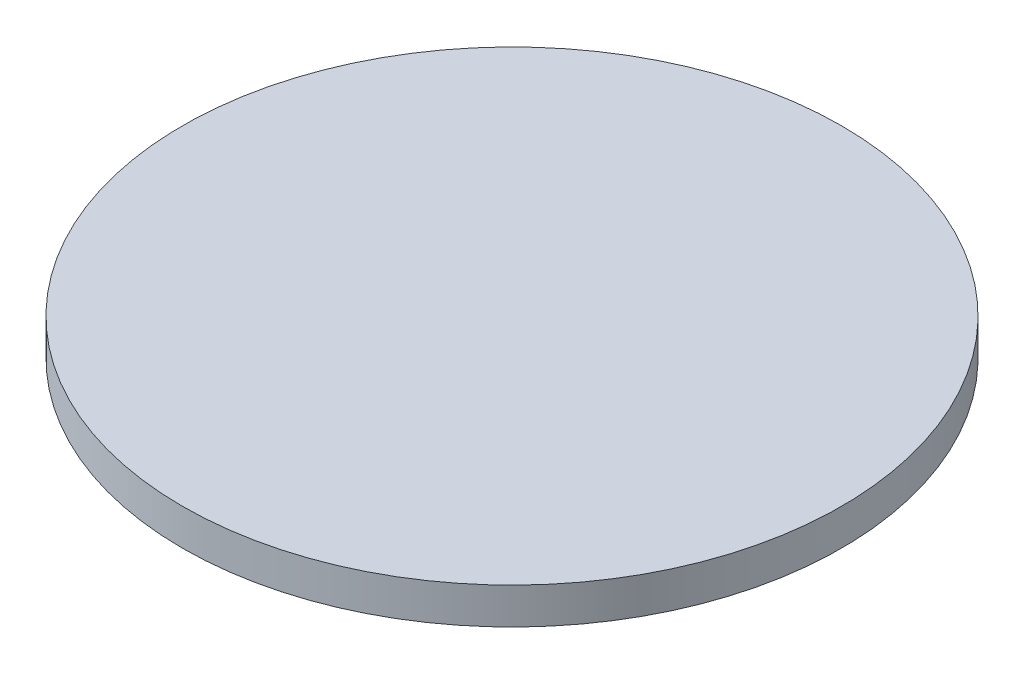
ISO-10303-21;
HEADER;
FILE_DESCRIPTION(('STEP AP214'),'2;1');
FILE_NAME('part.step','',(''),(''),'','','');
FILE_SCHEMA(('AUTOMOTIVE_DESIGN { 1 0 10303 214 1 1 1 1 }'));
ENDSEC;
DATA;
#1=APPLICATION_CONTEXT('core data for automotive mechanical design processes');
#2=APPLICATION_PROTOCOL_DEFINITION('international standard','automotive_design',2000,#1);
#3=PRODUCT_CONTEXT('',#1,'mechanical');
#4=PRODUCT('Part','Part','',(#3));
#5=PRODUCT_RELATED_PRODUCT_CATEGORY('part','',(#4));
#6=PRODUCT_DEFINITION_FORMATION('','',#4);
#7=PRODUCT_DEFINITION_CONTEXT('part definition',#1,'design');
#8=PRODUCT_DEFINITION('design','',#6,#7);
#9=PRODUCT_DEFINITION_SHAPE('','',#8);
#10=(LENGTH_UNIT() NAMED_UNIT(*) SI_UNIT(.MILLI.,.METRE.));
#11=(NAMED_UNIT(*) PLANE_ANGLE_UNIT() SI_UNIT($,.RADIAN.));
#12=(NAMED_UNIT(*) SI_UNIT($,.STERADIAN.) SOLID_ANGLE_UNIT());
#13=UNCERTAINTY_MEASURE_WITH_UNIT(LENGTH_MEASURE(1.E-05),#10,'distance_accuracy_value','');
#14=(GEOMETRIC_REPRESENTATION_CONTEXT(3) GLOBAL_UNCERTAINTY_ASSIGNED_CONTEXT((#13)) GLOBAL_UNIT_ASSIGNED_CONTEXT((#10,
#11,#12)) REPRESENTATION_CONTEXT('',''));
#15=CARTESIAN_POINT('',(0.,0.,0.));
#16=DIRECTION('',(0.,0.,1.));
#17=DIRECTION('',(1.,0.,0.));
#18=AXIS2_PLACEMENT_3D('',#15,#16,#17);
#19=CARTESIAN_POINT('',(0.,3.,0.));
#20=DIRECTION('',(0.,-1.,0.));
#21=DIRECTION('',(0.,0.,-1.));
#22=AXIS2_PLACEMENT_3D('',#19,#20,#21);
#23=CYLINDRICAL_SURFACE('',#22,27.225);
#24=CARTESIAN_POINT('',(0.,3.,0.));
#25=DIRECTION('',(0.,1.,0.));
#26=DIRECTION('',(0.,0.,1.));
#27=AXIS2_PLACEMENT_3D('',#24,#25,#26);
#28=CIRCLE('',#27,27.225);
#29=CARTESIAN_POINT('',(0.,3.,27.225));
#30=VERTEX_POINT('',#29);
#31=EDGE_CURVE('E10',#30,#30,#28,.T.);
#32=ORIENTED_EDGE('',*,*,#31,.F.);
#33=EDGE_LOOP('',(#32));
#34=FACE_BOUND('',#33,.T.);
#35=CARTESIAN_POINT('',(0.,0.,0.));
#36=DIRECTION('',(0.,1.,0.));
#37=DIRECTION('',(0.,0.,1.));
#38=AXIS2_PLACEMENT_3D('',#35,#36,#37);
#39=CIRCLE('',#38,27.225);
#40=CARTESIAN_POINT('',(0.,0.,27.225));
#41=VERTEX_POINT('',#40);
#42=EDGE_CURVE('E33',#41,#41,#39,.T.);
#43=ORIENTED_EDGE('',*,*,#42,.T.);
#44=EDGE_LOOP('',(#43));
#45=FACE_BOUND('',#44,.T.);
#46=ADVANCED_FACE('F30',(#34,#45),#23,.T.);
#47=CARTESIAN_POINT('',(0.,3.,0.));
#48=DIRECTION('',(0.,1.,0.));
#49=DIRECTION('',(0.,0.,1.));
#50=AXIS2_PLACEMENT_3D('',#47,#48,#49);
#51=PLANE('',#50);
#52=ORIENTED_EDGE('',*,*,#31,.T.);
#53=EDGE_LOOP('',(#52));
#54=FACE_BOUND('',#53,.T.);
#55=ADVANCED_FACE('F45',(#54),#51,.T.);
#56=CARTESIAN_POINT('',(0.,0.,0.));
#57=DIRECTION('',(0.,1.,0.));
#58=DIRECTION('',(0.,0.,1.));
#59=AXIS2_PLACEMENT_3D('',#56,#57,#58);
#60=PLANE('',#59);
#61=ORIENTED_EDGE('',*,*,#42,.F.);
#62=EDGE_LOOP('',(#61));
#63=FACE_BOUND('',#62,.T.);
#64=ADVANCED_FACE('F43',(#63),#60,.F.);
#65=CLOSED_SHELL('',(#46,#55,#64));
#66=MANIFOLD_SOLID_BREP('B2',#65);
#67=ADVANCED_BREP_SHAPE_REPRESENTATION('',(#18,#66),#14);
#68=SHAPE_DEFINITION_REPRESENTATION(#9,#67);
ENDSEC;
END-ISO-10303-21;
